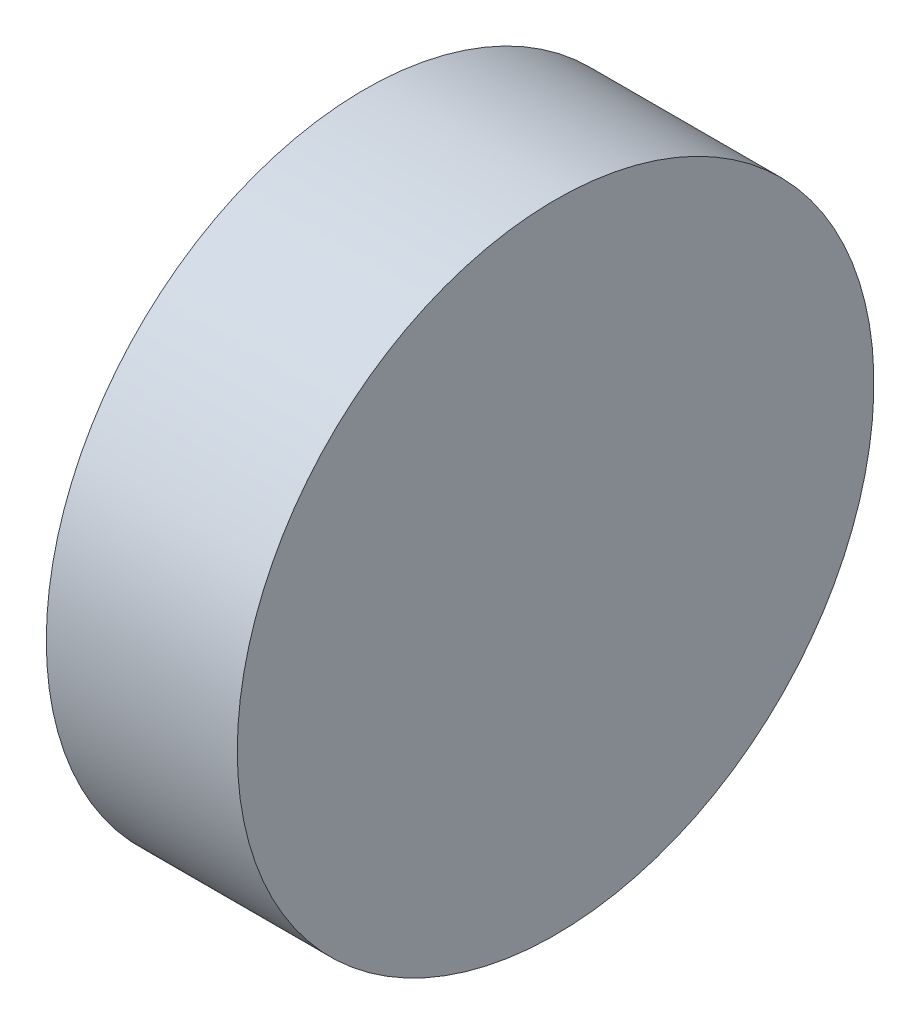
ISO-10303-21;
HEADER;
FILE_DESCRIPTION(('STEP AP214'),'2;1');
FILE_NAME('part.step','',(''),(''),'','','');
FILE_SCHEMA(('AUTOMOTIVE_DESIGN { 1 0 10303 214 1 1 1 1 }'));
ENDSEC;
DATA;
#1=APPLICATION_CONTEXT('core data for automotive mechanical design processes');
#2=APPLICATION_PROTOCOL_DEFINITION('international standard','automotive_design',2000,#1);
#3=PRODUCT_CONTEXT('',#1,'mechanical');
#4=PRODUCT('Part','Part','',(#3));
#5=PRODUCT_RELATED_PRODUCT_CATEGORY('part','',(#4));
#6=PRODUCT_DEFINITION_FORMATION('','',#4);
#7=PRODUCT_DEFINITION_CONTEXT('part definition',#1,'design');
#8=PRODUCT_DEFINITION('design','',#6,#7);
#9=PRODUCT_DEFINITION_SHAPE('','',#8);
#10=(LENGTH_UNIT() NAMED_UNIT(*) SI_UNIT(.MILLI.,.METRE.));
#11=(NAMED_UNIT(*) PLANE_ANGLE_UNIT() SI_UNIT($,.RADIAN.));
#12=(NAMED_UNIT(*) SI_UNIT($,.STERADIAN.) SOLID_ANGLE_UNIT());
#13=UNCERTAINTY_MEASURE_WITH_UNIT(LENGTH_MEASURE(1.E-05),#10,'distance_accuracy_value','');
#14=(GEOMETRIC_REPRESENTATION_CONTEXT(3) GLOBAL_UNCERTAINTY_ASSIGNED_CONTEXT((#13)) GLOBAL_UNIT_ASSIGNED_CONTEXT((#10,
#11,#12)) REPRESENTATION_CONTEXT('',''));
#15=CARTESIAN_POINT('',(0.,0.,0.));
#16=DIRECTION('',(0.,0.,1.));
#17=DIRECTION('',(1.,0.,0.));
#18=AXIS2_PLACEMENT_3D('',#15,#16,#17);
#19=CARTESIAN_POINT('',(130.100867635708,38.6465896745077,0.));
#20=DIRECTION('',(1.,0.,0.));
#21=DIRECTION('',(0.,0.,-1.));
#22=AXIS2_PLACEMENT_3D('',#19,#20,#21);
#23=PLANE('',#22);
#24=CARTESIAN_POINT('',(130.100867635708,38.6465896745077,0.));
#25=DIRECTION('',(-1.,0.,0.));
#26=DIRECTION('',(0.,0.,1.));
#27=AXIS2_PLACEMENT_3D('',#24,#25,#26);
#28=CIRCLE('',#27,10.);
#29=CARTESIAN_POINT('',(130.100867635708,38.6465896745077,10.));
#30=VERTEX_POINT('',#29);
#31=EDGE_CURVE('E10',#30,#30,#28,.T.);
#32=ORIENTED_EDGE('',*,*,#31,.T.);
#33=EDGE_LOOP('',(#32));
#34=FACE_BOUND('',#33,.T.);
#35=ADVANCED_FACE('F35',(#34),#23,.F.);
#36=CARTESIAN_POINT('',(127.000400996308,38.6465896745077,0.));
#37=DIRECTION('',(-1.,0.,0.));
#38=DIRECTION('',(0.,0.,1.));
#39=AXIS2_PLACEMENT_3D('',#36,#37,#38);
#40=CYLINDRICAL_SURFACE('',#39,10.);
#41=ORIENTED_EDGE('',*,*,#31,.F.);
#42=EDGE_LOOP('',(#41));
#43=FACE_BOUND('',#42,.T.);
#44=CARTESIAN_POINT('',(136.100867635708,38.6465896745077,0.));
#45=DIRECTION('',(-1.,0.,0.));
#46=DIRECTION('',(0.,0.,1.));
#47=AXIS2_PLACEMENT_3D('',#44,#45,#46);
#48=CIRCLE('',#47,10.);
#49=CARTESIAN_POINT('',(136.100867635708,38.6465896745077,10.));
#50=VERTEX_POINT('',#49);
#51=EDGE_CURVE('E41',#50,#50,#48,.T.);
#52=ORIENTED_EDGE('',*,*,#51,.T.);
#53=EDGE_LOOP('',(#52));
#54=FACE_BOUND('',#53,.T.);
#55=ADVANCED_FACE('F47',(#43,#54),#40,.T.);
#56=CARTESIAN_POINT('',(136.100867635708,48.6465896745077,0.));
#57=DIRECTION('',(-1.,0.,0.));
#58=DIRECTION('',(0.,0.,1.));
#59=AXIS2_PLACEMENT_3D('',#56,#57,#58);
#60=PLANE('',#59);
#61=ORIENTED_EDGE('',*,*,#51,.F.);
#62=EDGE_LOOP('',(#61));
#63=FACE_BOUND('',#62,.T.);
#64=ADVANCED_FACE('F49',(#63),#60,.F.);
#65=CLOSED_SHELL('',(#35,#55,#64));
#66=MANIFOLD_SOLID_BREP('B2',#65);
#67=ADVANCED_BREP_SHAPE_REPRESENTATION('',(#18,#66),#14);
#68=SHAPE_DEFINITION_REPRESENTATION(#9,#67);
ENDSEC;
END-ISO-10303-21;
